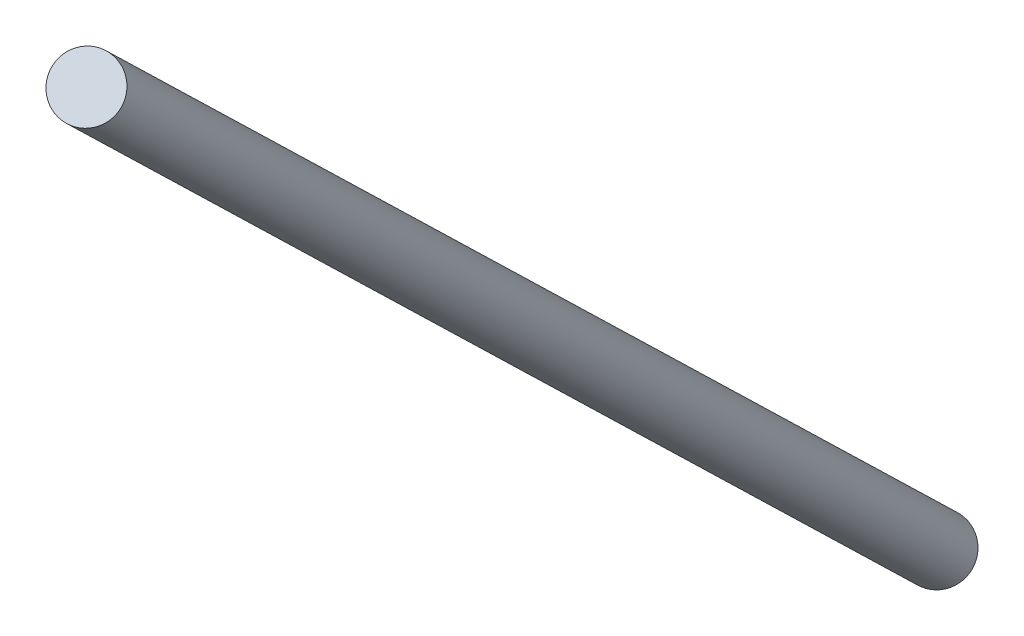
ISO-10303-21;
HEADER;
FILE_DESCRIPTION(('STEP AP214'),'2;1');
FILE_NAME('part.step','',(''),(''),'','','');
FILE_SCHEMA(('AUTOMOTIVE_DESIGN { 1 0 10303 214 1 1 1 1 }'));
ENDSEC;
DATA;
#1=APPLICATION_CONTEXT('core data for automotive mechanical design processes');
#2=APPLICATION_PROTOCOL_DEFINITION('international standard','automotive_design',2000,#1);
#3=PRODUCT_CONTEXT('',#1,'mechanical');
#4=PRODUCT('Part','Part','',(#3));
#5=PRODUCT_RELATED_PRODUCT_CATEGORY('part','',(#4));
#6=PRODUCT_DEFINITION_FORMATION('','',#4);
#7=PRODUCT_DEFINITION_CONTEXT('part definition',#1,'design');
#8=PRODUCT_DEFINITION('design','',#6,#7);
#9=PRODUCT_DEFINITION_SHAPE('','',#8);
#10=(LENGTH_UNIT() NAMED_UNIT(*) SI_UNIT(.MILLI.,.METRE.));
#11=(NAMED_UNIT(*) PLANE_ANGLE_UNIT() SI_UNIT($,.RADIAN.));
#12=(NAMED_UNIT(*) SI_UNIT($,.STERADIAN.) SOLID_ANGLE_UNIT());
#13=UNCERTAINTY_MEASURE_WITH_UNIT(LENGTH_MEASURE(1.E-05),#10,'distance_accuracy_value','');
#14=(GEOMETRIC_REPRESENTATION_CONTEXT(3) GLOBAL_UNCERTAINTY_ASSIGNED_CONTEXT((#13)) GLOBAL_UNIT_ASSIGNED_CONTEXT((#10,
#11,#12)) REPRESENTATION_CONTEXT('',''));
#15=CARTESIAN_POINT('',(0.,0.,0.));
#16=DIRECTION('',(0.,0.,1.));
#17=DIRECTION('',(1.,0.,0.));
#18=AXIS2_PLACEMENT_3D('',#15,#16,#17);
#19=CARTESIAN_POINT('',(74.0930250015157,130.476867940374,132.234679939096));
#20=DIRECTION('',(-0.370465125007578,-0.652384339701869,-0.661173399695478));
#21=DIRECTION('',(0.,0.71182212303045,-0.70235978327665));
#22=AXIS2_PLACEMENT_3D('',#19,#20,#21);
#23=CYLINDRICAL_SURFACE('',#22,2.);
#24=CARTESIAN_POINT('',(74.0930250015157,130.476867940374,132.234679939096));
#25=DIRECTION('',(0.370465125007578,0.652384339701869,0.661173399695478));
#26=DIRECTION('',(0.,-0.71182212303045,0.70235978327665));
#27=AXIS2_PLACEMENT_3D('',#24,#25,#26);
#28=CIRCLE('',#27,2.);
#29=CARTESIAN_POINT('',(74.0930250015157,129.053223694313,133.639399505649));
#30=VERTEX_POINT('',#29);
#31=EDGE_CURVE('E10',#30,#30,#28,.T.);
#32=ORIENTED_EDGE('',*,*,#31,.F.);
#33=EDGE_LOOP('',(#32));
#34=FACE_BOUND('',#33,.T.);
#35=CARTESIAN_POINT('',(0.,0.,0.));
#36=DIRECTION('',(0.370465125007578,0.652384339701869,0.661173399695478));
#37=DIRECTION('',(0.,-0.71182212303045,0.70235978327665));
#38=AXIS2_PLACEMENT_3D('',#35,#36,#37);
#39=CIRCLE('',#38,2.);
#40=CARTESIAN_POINT('',(0.,-1.4236442460609,1.4047195665533));
#41=VERTEX_POINT('',#40);
#42=EDGE_CURVE('E38',#41,#41,#39,.T.);
#43=ORIENTED_EDGE('',*,*,#42,.T.);
#44=EDGE_LOOP('',(#43));
#45=FACE_BOUND('',#44,.T.);
#46=ADVANCED_FACE('F35',(#34,#45),#23,.T.);
#47=CARTESIAN_POINT('',(74.0930250015157,130.476867940374,132.234679939096));
#48=DIRECTION('',(0.370465125007578,0.652384339701869,0.661173399695478));
#49=DIRECTION('',(0.,-0.71182212303045,0.70235978327665));
#50=AXIS2_PLACEMENT_3D('',#47,#48,#49);
#51=PLANE('',#50);
#52=ORIENTED_EDGE('',*,*,#31,.T.);
#53=EDGE_LOOP('',(#52));
#54=FACE_BOUND('',#53,.T.);
#55=ADVANCED_FACE('F50',(#54),#51,.T.);
#56=CARTESIAN_POINT('',(0.,0.,0.));
#57=DIRECTION('',(0.370465125007578,0.652384339701869,0.661173399695478));
#58=DIRECTION('',(0.,-0.71182212303045,0.70235978327665));
#59=AXIS2_PLACEMENT_3D('',#56,#57,#58);
#60=PLANE('',#59);
#61=ORIENTED_EDGE('',*,*,#42,.F.);
#62=EDGE_LOOP('',(#61));
#63=FACE_BOUND('',#62,.T.);
#64=ADVANCED_FACE('F48',(#63),#60,.F.);
#65=CLOSED_SHELL('',(#46,#55,#64));
#66=MANIFOLD_SOLID_BREP('B2',#65);
#67=ADVANCED_BREP_SHAPE_REPRESENTATION('',(#18,#66),#14);
#68=SHAPE_DEFINITION_REPRESENTATION(#9,#67);
ENDSEC;
END-ISO-10303-21;
